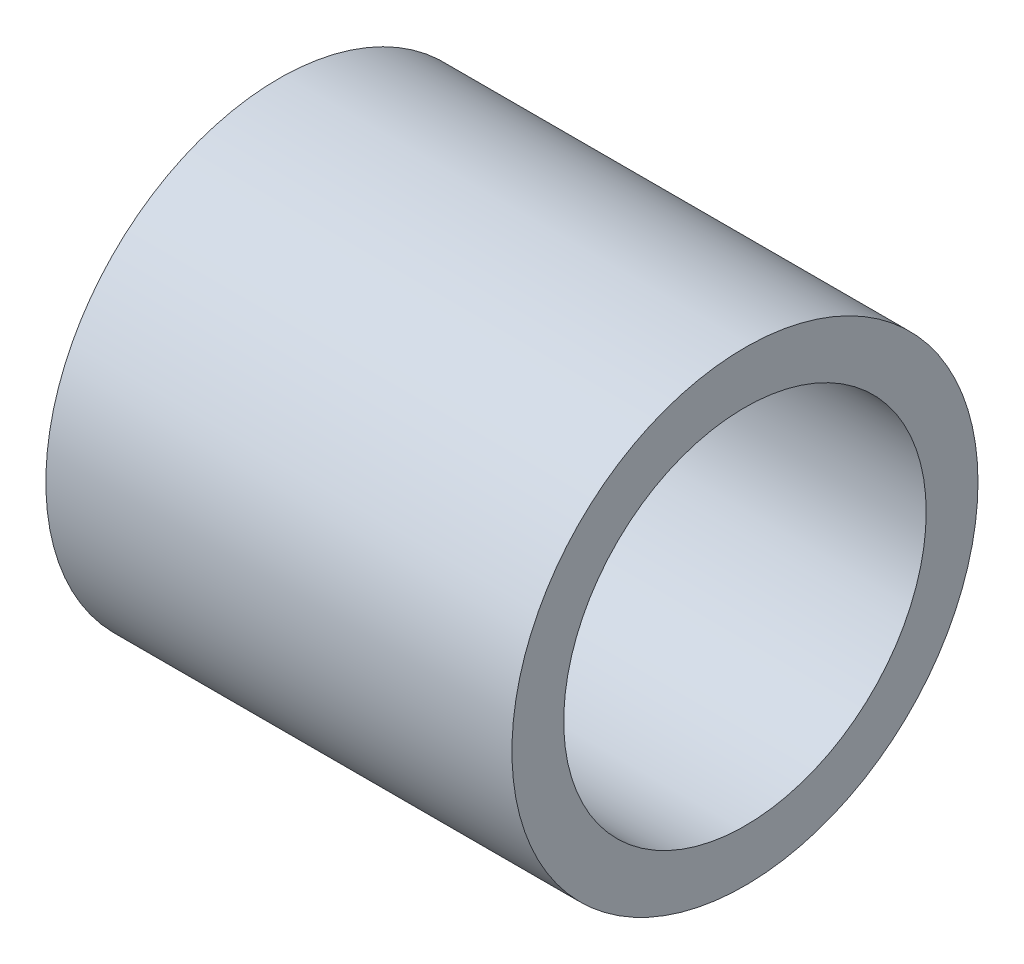
ISO-10303-21;
HEADER;
FILE_DESCRIPTION(('STEP AP214'),'2;1');
FILE_NAME('part.step','',(''),(''),'','','');
FILE_SCHEMA(('AUTOMOTIVE_DESIGN { 1 0 10303 214 1 1 1 1 }'));
ENDSEC;
DATA;
#1=APPLICATION_CONTEXT('core data for automotive mechanical design processes');
#2=APPLICATION_PROTOCOL_DEFINITION('international standard','automotive_design',2000,#1);
#3=PRODUCT_CONTEXT('',#1,'mechanical');
#4=PRODUCT('Part','Part','',(#3));
#5=PRODUCT_RELATED_PRODUCT_CATEGORY('part','',(#4));
#6=PRODUCT_DEFINITION_FORMATION('','',#4);
#7=PRODUCT_DEFINITION_CONTEXT('part definition',#1,'design');
#8=PRODUCT_DEFINITION('design','',#6,#7);
#9=PRODUCT_DEFINITION_SHAPE('','',#8);
#10=(LENGTH_UNIT() NAMED_UNIT(*) SI_UNIT(.MILLI.,.METRE.));
#11=(NAMED_UNIT(*) PLANE_ANGLE_UNIT() SI_UNIT($,.RADIAN.));
#12=(NAMED_UNIT(*) SI_UNIT($,.STERADIAN.) SOLID_ANGLE_UNIT());
#13=UNCERTAINTY_MEASURE_WITH_UNIT(LENGTH_MEASURE(1.E-05),#10,'distance_accuracy_value','');
#14=(GEOMETRIC_REPRESENTATION_CONTEXT(3) GLOBAL_UNCERTAINTY_ASSIGNED_CONTEXT((#13)) GLOBAL_UNIT_ASSIGNED_CONTEXT((#10,
#11,#12)) REPRESENTATION_CONTEXT('',''));
#15=CARTESIAN_POINT('',(0.,0.,0.));
#16=DIRECTION('',(0.,0.,1.));
#17=DIRECTION('',(1.,0.,0.));
#18=AXIS2_PLACEMENT_3D('',#15,#16,#17);
#19=CARTESIAN_POINT('',(-18.,0.,0.));
#20=DIRECTION('',(1.,0.,0.));
#21=DIRECTION('',(0.,0.,-1.));
#22=AXIS2_PLACEMENT_3D('',#19,#20,#21);
#23=CYLINDRICAL_SURFACE('',#22,9.);
#24=CARTESIAN_POINT('',(-18.,0.,0.));
#25=DIRECTION('',(1.,0.,0.));
#26=DIRECTION('',(0.,0.,-1.));
#27=AXIS2_PLACEMENT_3D('',#24,#25,#26);
#28=CIRCLE('',#27,9.);
#29=CARTESIAN_POINT('',(-18.,0.,-9.));
#30=VERTEX_POINT('',#29);
#31=EDGE_CURVE('E10',#30,#30,#28,.T.);
#32=ORIENTED_EDGE('',*,*,#31,.T.);
#33=EDGE_LOOP('',(#32));
#34=FACE_BOUND('',#33,.T.);
#35=CARTESIAN_POINT('',(0.,0.,0.));
#36=DIRECTION('',(1.,0.,0.));
#37=DIRECTION('',(0.,0.,-1.));
#38=AXIS2_PLACEMENT_3D('',#35,#36,#37);
#39=CIRCLE('',#38,9.);
#40=CARTESIAN_POINT('',(0.,0.,-9.));
#41=VERTEX_POINT('',#40);
#42=EDGE_CURVE('E36',#41,#41,#39,.T.);
#43=ORIENTED_EDGE('',*,*,#42,.F.);
#44=EDGE_LOOP('',(#43));
#45=FACE_BOUND('',#44,.T.);
#46=ADVANCED_FACE('F33',(#34,#45),#23,.T.);
#47=CARTESIAN_POINT('',(-18.,0.,0.));
#48=DIRECTION('',(1.,0.,0.));
#49=DIRECTION('',(0.,0.,-1.));
#50=AXIS2_PLACEMENT_3D('',#47,#48,#49);
#51=PLANE('',#50);
#52=CARTESIAN_POINT('',(-18.,0.,0.));
#53=DIRECTION('',(1.,0.,0.));
#54=DIRECTION('',(0.,0.,-1.));
#55=AXIS2_PLACEMENT_3D('',#52,#53,#54);
#56=CIRCLE('',#55,7.);
#57=CARTESIAN_POINT('',(-18.,0.,-7.));
#58=VERTEX_POINT('',#57);
#59=EDGE_CURVE('E43',#58,#58,#56,.T.);
#60=ORIENTED_EDGE('',*,*,#59,.T.);
#61=EDGE_LOOP('',(#60));
#62=FACE_BOUND('',#61,.T.);
#63=ORIENTED_EDGE('',*,*,#31,.F.);
#64=EDGE_LOOP('',(#63));
#65=FACE_BOUND('',#64,.T.);
#66=ADVANCED_FACE('F51',(#62,#65),#51,.F.);
#67=CARTESIAN_POINT('',(0.,0.,0.));
#68=DIRECTION('',(1.,0.,0.));
#69=DIRECTION('',(0.,0.,-1.));
#70=AXIS2_PLACEMENT_3D('',#67,#68,#69);
#71=PLANE('',#70);
#72=CARTESIAN_POINT('',(0.,0.,0.));
#73=DIRECTION('',(1.,0.,0.));
#74=DIRECTION('',(0.,0.,-1.));
#75=AXIS2_PLACEMENT_3D('',#72,#73,#74);
#76=CIRCLE('',#75,7.);
#77=CARTESIAN_POINT('',(0.,0.,-7.));
#78=VERTEX_POINT('',#77);
#79=EDGE_CURVE('E45',#78,#78,#76,.T.);
#80=ORIENTED_EDGE('',*,*,#79,.F.);
#81=EDGE_LOOP('',(#80));
#82=FACE_BOUND('',#81,.T.);
#83=ORIENTED_EDGE('',*,*,#42,.T.);
#84=EDGE_LOOP('',(#83));
#85=FACE_BOUND('',#84,.T.);
#86=ADVANCED_FACE('F57',(#82,#85),#71,.T.);
#87=CARTESIAN_POINT('',(-18.,0.,0.));
#88=DIRECTION('',(1.,0.,0.));
#89=DIRECTION('',(0.,0.,-1.));
#90=AXIS2_PLACEMENT_3D('',#87,#88,#89);
#91=CYLINDRICAL_SURFACE('',#90,7.);
#92=ORIENTED_EDGE('',*,*,#59,.F.);
#93=EDGE_LOOP('',(#92));
#94=FACE_BOUND('',#93,.T.);
#95=ORIENTED_EDGE('',*,*,#79,.T.);
#96=EDGE_LOOP('',(#95));
#97=FACE_BOUND('',#96,.T.);
#98=ADVANCED_FACE('F54',(#94,#97),#91,.F.);
#99=CLOSED_SHELL('',(#46,#66,#86,#98));
#100=MANIFOLD_SOLID_BREP('B2',#99);
#101=ADVANCED_BREP_SHAPE_REPRESENTATION('',(#18,#100),#14);
#102=SHAPE_DEFINITION_REPRESENTATION(#9,#101);
ENDSEC;
END-ISO-10303-21;
